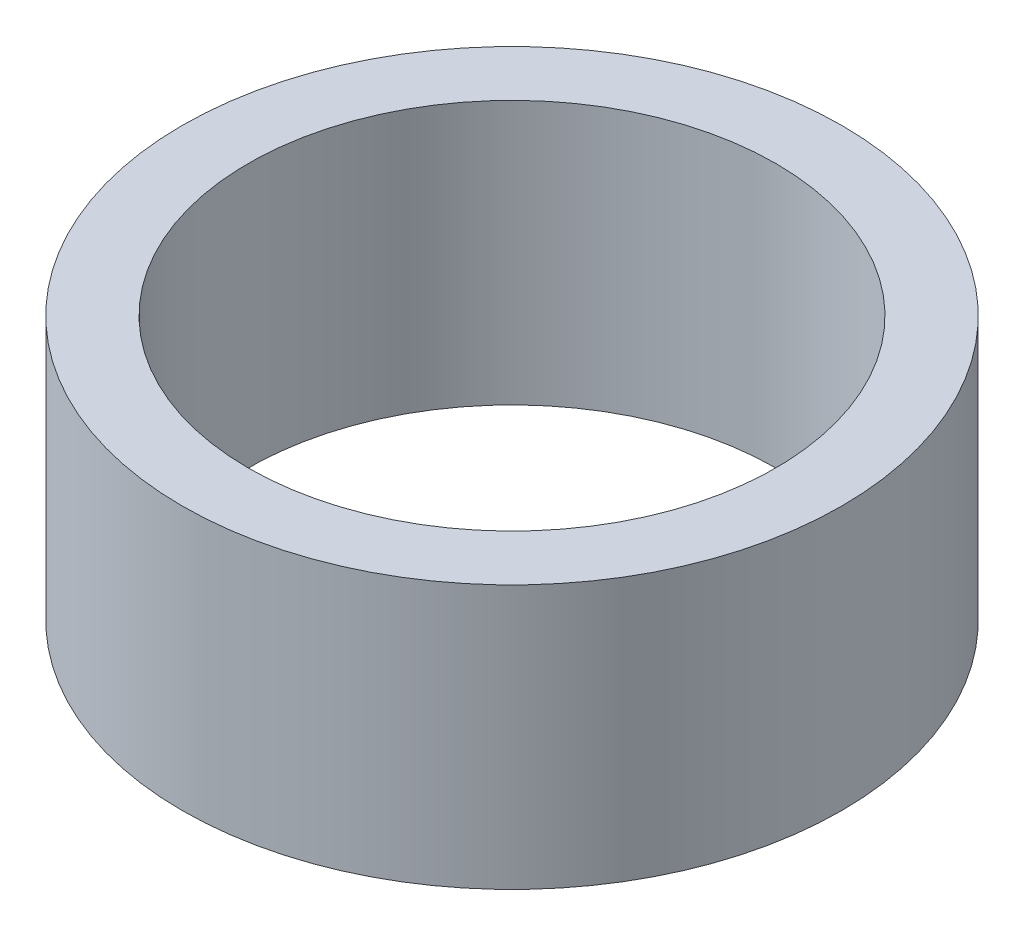
ISO-10303-21;
HEADER;
FILE_DESCRIPTION(('STEP AP214'),'2;1');
FILE_NAME('part.step','',(''),(''),'','','');
FILE_SCHEMA(('AUTOMOTIVE_DESIGN { 1 0 10303 214 1 1 1 1 }'));
ENDSEC;
DATA;
#1=APPLICATION_CONTEXT('core data for automotive mechanical design processes');
#2=APPLICATION_PROTOCOL_DEFINITION('international standard','automotive_design',2000,#1);
#3=PRODUCT_CONTEXT('',#1,'mechanical');
#4=PRODUCT('Part','Part','',(#3));
#5=PRODUCT_RELATED_PRODUCT_CATEGORY('part','',(#4));
#6=PRODUCT_DEFINITION_FORMATION('','',#4);
#7=PRODUCT_DEFINITION_CONTEXT('part definition',#1,'design');
#8=PRODUCT_DEFINITION('design','',#6,#7);
#9=PRODUCT_DEFINITION_SHAPE('','',#8);
#10=(LENGTH_UNIT() NAMED_UNIT(*) SI_UNIT(.MILLI.,.METRE.));
#11=(NAMED_UNIT(*) PLANE_ANGLE_UNIT() SI_UNIT($,.RADIAN.));
#12=(NAMED_UNIT(*) SI_UNIT($,.STERADIAN.) SOLID_ANGLE_UNIT());
#13=UNCERTAINTY_MEASURE_WITH_UNIT(LENGTH_MEASURE(1.E-05),#10,'distance_accuracy_value','');
#14=(GEOMETRIC_REPRESENTATION_CONTEXT(3) GLOBAL_UNCERTAINTY_ASSIGNED_CONTEXT((#13)) GLOBAL_UNIT_ASSIGNED_CONTEXT((#10,
#11,#12)) REPRESENTATION_CONTEXT('',''));
#15=CARTESIAN_POINT('',(0.,0.,0.));
#16=DIRECTION('',(0.,0.,1.));
#17=DIRECTION('',(1.,0.,0.));
#18=AXIS2_PLACEMENT_3D('',#15,#16,#17);
#19=CARTESIAN_POINT('',(0.,20.,0.));
#20=DIRECTION('',(0.,1.,0.));
#21=DIRECTION('',(0.,0.,1.));
#22=AXIS2_PLACEMENT_3D('',#19,#20,#21);
#23=PLANE('',#22);
#24=CARTESIAN_POINT('',(0.,20.,0.));
#25=DIRECTION('',(0.,1.,0.));
#26=DIRECTION('',(0.,0.,1.));
#27=AXIS2_PLACEMENT_3D('',#24,#25,#26);
#28=CIRCLE('',#27,25.);
#29=CARTESIAN_POINT('',(0.,20.,25.));
#30=VERTEX_POINT('',#29);
#31=EDGE_CURVE('E10',#30,#30,#28,.T.);
#32=ORIENTED_EDGE('',*,*,#31,.T.);
#33=EDGE_LOOP('',(#32));
#34=FACE_BOUND('',#33,.T.);
#35=CARTESIAN_POINT('',(0.,20.,0.));
#36=DIRECTION('',(0.,1.,0.));
#37=DIRECTION('',(0.,0.,1.));
#38=AXIS2_PLACEMENT_3D('',#35,#36,#37);
#39=CIRCLE('',#38,20.);
#40=CARTESIAN_POINT('',(0.,20.,20.));
#41=VERTEX_POINT('',#40);
#42=EDGE_CURVE('E50',#41,#41,#39,.T.);
#43=ORIENTED_EDGE('',*,*,#42,.F.);
#44=EDGE_LOOP('',(#43));
#45=FACE_BOUND('',#44,.T.);
#46=ADVANCED_FACE('F37',(#34,#45),#23,.T.);
#47=CARTESIAN_POINT('',(0.,0.,0.));
#48=DIRECTION('',(0.,1.,0.));
#49=DIRECTION('',(0.,0.,1.));
#50=AXIS2_PLACEMENT_3D('',#47,#48,#49);
#51=PLANE('',#50);
#52=CARTESIAN_POINT('',(0.,0.,0.));
#53=DIRECTION('',(0.,1.,0.));
#54=DIRECTION('',(0.,0.,1.));
#55=AXIS2_PLACEMENT_3D('',#52,#53,#54);
#56=CIRCLE('',#55,25.);
#57=CARTESIAN_POINT('',(0.,0.,25.));
#58=VERTEX_POINT('',#57);
#59=EDGE_CURVE('E41',#58,#58,#56,.T.);
#60=ORIENTED_EDGE('',*,*,#59,.F.);
#61=EDGE_LOOP('',(#60));
#62=FACE_BOUND('',#61,.T.);
#63=CARTESIAN_POINT('',(0.,0.,0.));
#64=DIRECTION('',(0.,1.,0.));
#65=DIRECTION('',(0.,0.,1.));
#66=AXIS2_PLACEMENT_3D('',#63,#64,#65);
#67=CIRCLE('',#66,20.);
#68=CARTESIAN_POINT('',(0.,0.,20.));
#69=VERTEX_POINT('',#68);
#70=EDGE_CURVE('E52',#69,#69,#67,.T.);
#71=ORIENTED_EDGE('',*,*,#70,.T.);
#72=EDGE_LOOP('',(#71));
#73=FACE_BOUND('',#72,.T.);
#74=ADVANCED_FACE('F64',(#62,#73),#51,.F.);
#75=CARTESIAN_POINT('',(0.,20.,0.));
#76=DIRECTION('',(0.,-1.,0.));
#77=DIRECTION('',(0.,0.,-1.));
#78=AXIS2_PLACEMENT_3D('',#75,#76,#77);
#79=CYLINDRICAL_SURFACE('',#78,25.);
#80=ORIENTED_EDGE('',*,*,#31,.F.);
#81=EDGE_LOOP('',(#80));
#82=FACE_BOUND('',#81,.T.);
#83=ORIENTED_EDGE('',*,*,#59,.T.);
#84=EDGE_LOOP('',(#83));
#85=FACE_BOUND('',#84,.T.);
#86=ADVANCED_FACE('F39',(#82,#85),#79,.T.);
#87=CARTESIAN_POINT('',(0.,20.,0.));
#88=DIRECTION('',(0.,-1.,0.));
#89=DIRECTION('',(0.,0.,-1.));
#90=AXIS2_PLACEMENT_3D('',#87,#88,#89);
#91=CYLINDRICAL_SURFACE('',#90,20.);
#92=ORIENTED_EDGE('',*,*,#42,.T.);
#93=EDGE_LOOP('',(#92));
#94=FACE_BOUND('',#93,.T.);
#95=ORIENTED_EDGE('',*,*,#70,.F.);
#96=EDGE_LOOP('',(#95));
#97=FACE_BOUND('',#96,.T.);
#98=ADVANCED_FACE('F60',(#94,#97),#91,.F.);
#99=CLOSED_SHELL('',(#46,#74,#86,#98));
#100=MANIFOLD_SOLID_BREP('B2',#99);
#101=ADVANCED_BREP_SHAPE_REPRESENTATION('',(#18,#100),#14);
#102=SHAPE_DEFINITION_REPRESENTATION(#9,#101);
ENDSEC;
END-ISO-10303-21;
